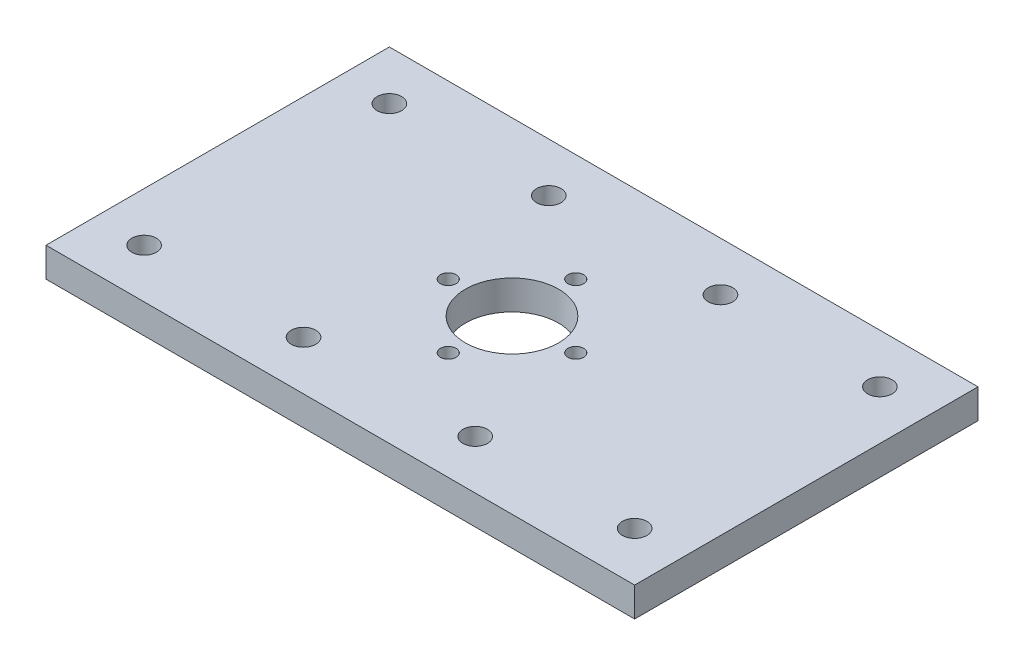
ISO-10303-21;
HEADER;
FILE_DESCRIPTION(('STEP AP214'),'2;1');
FILE_NAME('part.step','',(''),(''),'','','');
FILE_SCHEMA(('AUTOMOTIVE_DESIGN { 1 0 10303 214 1 1 1 1 }'));
ENDSEC;
DATA;
#1=APPLICATION_CONTEXT('core data for automotive mechanical design processes');
#2=APPLICATION_PROTOCOL_DEFINITION('international standard','automotive_design',2000,#1);
#3=PRODUCT_CONTEXT('',#1,'mechanical');
#4=PRODUCT('Part','Part','',(#3));
#5=PRODUCT_RELATED_PRODUCT_CATEGORY('part','',(#4));
#6=PRODUCT_DEFINITION_FORMATION('','',#4);
#7=PRODUCT_DEFINITION_CONTEXT('part definition',#1,'design');
#8=PRODUCT_DEFINITION('design','',#6,#7);
#9=PRODUCT_DEFINITION_SHAPE('','',#8);
#10=(LENGTH_UNIT() NAMED_UNIT(*) SI_UNIT(.MILLI.,.METRE.));
#11=(NAMED_UNIT(*) PLANE_ANGLE_UNIT() SI_UNIT($,.RADIAN.));
#12=(NAMED_UNIT(*) SI_UNIT($,.STERADIAN.) SOLID_ANGLE_UNIT());
#13=UNCERTAINTY_MEASURE_WITH_UNIT(LENGTH_MEASURE(1.E-05),#10,'distance_accuracy_value','');
#14=(GEOMETRIC_REPRESENTATION_CONTEXT(3) GLOBAL_UNCERTAINTY_ASSIGNED_CONTEXT((#13)) GLOBAL_UNIT_ASSIGNED_CONTEXT((#10,
#11,#12)) REPRESENTATION_CONTEXT('',''));
#15=CARTESIAN_POINT('',(0.,0.,0.));
#16=DIRECTION('',(0.,0.,1.));
#17=DIRECTION('',(1.,0.,0.));
#18=AXIS2_PLACEMENT_3D('',#15,#16,#17);
#19=CARTESIAN_POINT('',(0.,6.,0.));
#20=DIRECTION('',(0.,1.,0.));
#21=DIRECTION('',(0.,0.,1.));
#22=AXIS2_PLACEMENT_3D('',#19,#20,#21);
#23=PLANE('',#22);
#24=CARTESIAN_POINT('',(13.,6.,2.30718222304915E-13));
#25=DIRECTION('',(0.,-1.,0.));
#26=DIRECTION('',(0.,0.,-1.));
#27=AXIS2_PLACEMENT_3D('',#24,#25,#26);
#28=CIRCLE('',#27,1.6);
#29=CARTESIAN_POINT('',(13.,6.,-1.59999999999977));
#30=VERTEX_POINT('',#29);
#31=EDGE_CURVE('E200',#30,#30,#28,.T.);
#32=ORIENTED_EDGE('',*,*,#31,.T.);
#33=EDGE_LOOP('',(#32));
#34=FACE_BOUND('',#33,.T.);
#35=CARTESIAN_POINT('',(-2.76688394418301E-13,6.,13.));
#36=DIRECTION('',(0.,-1.,0.));
#37=DIRECTION('',(0.,0.,-1.));
#38=AXIS2_PLACEMENT_3D('',#35,#36,#37);
#39=CIRCLE('',#38,1.6);
#40=CARTESIAN_POINT('',(-2.76688394418301E-13,6.,11.4));
#41=VERTEX_POINT('',#40);
#42=EDGE_CURVE('E191',#41,#41,#39,.T.);
#43=ORIENTED_EDGE('',*,*,#42,.T.);
#44=EDGE_LOOP('',(#43));
#45=FACE_BOUND('',#44,.T.);
#46=CARTESIAN_POINT('',(-13.,6.,-3.17724801834725E-13));
#47=DIRECTION('',(0.,-1.,0.));
#48=DIRECTION('',(0.,0.,-1.));
#49=AXIS2_PLACEMENT_3D('',#46,#47,#48);
#50=CIRCLE('',#49,1.6);
#51=CARTESIAN_POINT('',(-13.,6.,-1.60000000000032));
#52=VERTEX_POINT('',#51);
#53=EDGE_CURVE('E182',#52,#52,#50,.T.);
#54=ORIENTED_EDGE('',*,*,#53,.T.);
#55=EDGE_LOOP('',(#54));
#56=FACE_BOUND('',#55,.T.);
#57=CARTESIAN_POINT('',(50.,6.,-25.));
#58=DIRECTION('',(0.,1.,0.));
#59=DIRECTION('',(0.,0.,-1.));
#60=AXIS2_PLACEMENT_3D('',#57,#58,#59);
#61=CIRCLE('',#60,2.5);
#62=CARTESIAN_POINT('',(50.,6.,-27.5));
#63=VERTEX_POINT('',#62);
#64=EDGE_CURVE('E165',#63,#63,#61,.T.);
#65=ORIENTED_EDGE('',*,*,#64,.F.);
#66=EDGE_LOOP('',(#65));
#67=FACE_BOUND('',#66,.T.);
#68=CARTESIAN_POINT('',(-50.,6.,25.));
#69=DIRECTION('',(0.,1.,0.));
#70=DIRECTION('',(0.,0.,-1.));
#71=AXIS2_PLACEMENT_3D('',#68,#69,#70);
#72=CIRCLE('',#71,2.5);
#73=CARTESIAN_POINT('',(-50.,6.,22.5));
#74=VERTEX_POINT('',#73);
#75=EDGE_CURVE('E153',#74,#74,#72,.T.);
#76=ORIENTED_EDGE('',*,*,#75,.F.);
#77=EDGE_LOOP('',(#76));
#78=FACE_BOUND('',#77,.T.);
#79=CARTESIAN_POINT('',(-17.5,6.,25.));
#80=DIRECTION('',(0.,1.,0.));
#81=DIRECTION('',(0.,0.,-1.));
#82=AXIS2_PLACEMENT_3D('',#79,#80,#81);
#83=CIRCLE('',#82,2.5);
#84=CARTESIAN_POINT('',(-17.5,6.,22.5));
#85=VERTEX_POINT('',#84);
#86=EDGE_CURVE('E141',#85,#85,#83,.T.);
#87=ORIENTED_EDGE('',*,*,#86,.F.);
#88=EDGE_LOOP('',(#87));
#89=FACE_BOUND('',#88,.T.);
#90=CARTESIAN_POINT('',(17.5,6.,-25.));
#91=DIRECTION('',(0.,1.,0.));
#92=DIRECTION('',(0.,0.,-1.));
#93=AXIS2_PLACEMENT_3D('',#90,#91,#92);
#94=CIRCLE('',#93,2.5);
#95=CARTESIAN_POINT('',(17.5,6.,-27.5));
#96=VERTEX_POINT('',#95);
#97=EDGE_CURVE('E129',#96,#96,#94,.T.);
#98=ORIENTED_EDGE('',*,*,#97,.F.);
#99=EDGE_LOOP('',(#98));
#100=FACE_BOUND('',#99,.T.);
#101=CARTESIAN_POINT('',(0.,6.,0.));
#102=DIRECTION('',(0.,1.,0.));
#103=DIRECTION('',(0.,0.,1.));
#104=AXIS2_PLACEMENT_3D('',#101,#102,#103);
#105=CIRCLE('',#104,9.5);
#106=CARTESIAN_POINT('',(0.,6.,9.5));
#107=VERTEX_POINT('',#106);
#108=EDGE_CURVE('E108',#107,#107,#105,.T.);
#109=ORIENTED_EDGE('',*,*,#108,.F.);
#110=EDGE_LOOP('',(#109));
#111=FACE_BOUND('',#110,.T.);
#112=DIRECTION('',(0.,0.,-1.));
#113=VECTOR('',#112,1.);
#114=CARTESIAN_POINT('',(60.,6.,-35.));
#115=LINE('',#114,#113);
#116=CARTESIAN_POINT('',(60.,6.,35.));
#117=VERTEX_POINT('',#116);
#118=CARTESIAN_POINT('',(60.,6.,-35.));
#119=VERTEX_POINT('',#118);
#120=EDGE_CURVE('E93',#117,#119,#115,.T.);
#121=ORIENTED_EDGE('',*,*,#120,.T.);
#122=DIRECTION('',(-1.,0.,0.));
#123=VECTOR('',#122,1.);
#124=CARTESIAN_POINT('',(-60.,6.,-35.));
#125=LINE('',#124,#123);
#126=CARTESIAN_POINT('',(-60.,6.,-35.));
#127=VERTEX_POINT('',#126);
#128=EDGE_CURVE('E88',#119,#127,#125,.T.);
#129=ORIENTED_EDGE('',*,*,#128,.T.);
#130=DIRECTION('',(0.,0.,1.));
#131=VECTOR('',#130,1.);
#132=CARTESIAN_POINT('',(-60.,6.,-35.));
#133=LINE('',#132,#131);
#134=CARTESIAN_POINT('',(-60.,6.,35.));
#135=VERTEX_POINT('',#134);
#136=EDGE_CURVE('E91',#127,#135,#133,.T.);
#137=ORIENTED_EDGE('',*,*,#136,.T.);
#138=DIRECTION('',(1.,0.,0.));
#139=VECTOR('',#138,1.);
#140=CARTESIAN_POINT('',(-60.,6.,35.));
#141=LINE('',#140,#139);
#142=EDGE_CURVE('E58',#135,#117,#141,.T.);
#143=ORIENTED_EDGE('',*,*,#142,.T.);
#144=EDGE_LOOP('',(#121,#129,#137,#143));
#145=FACE_BOUND('',#144,.T.);
#146=CARTESIAN_POINT('',(-17.5,6.,-25.));
#147=DIRECTION('',(0.,1.,0.));
#148=DIRECTION('',(0.,0.,1.));
#149=AXIS2_PLACEMENT_3D('',#146,#147,#148);
#150=CIRCLE('',#149,2.5);
#151=CARTESIAN_POINT('',(-17.5,6.,-22.5));
#152=VERTEX_POINT('',#151);
#153=EDGE_CURVE('E123',#152,#152,#150,.T.);
#154=ORIENTED_EDGE('',*,*,#153,.F.);
#155=EDGE_LOOP('',(#154));
#156=FACE_BOUND('',#155,.T.);
#157=CARTESIAN_POINT('',(17.5,6.,25.));
#158=DIRECTION('',(0.,1.,0.));
#159=DIRECTION('',(0.,0.,1.));
#160=AXIS2_PLACEMENT_3D('',#157,#158,#159);
#161=CIRCLE('',#160,2.5);
#162=CARTESIAN_POINT('',(17.5,6.,27.5));
#163=VERTEX_POINT('',#162);
#164=EDGE_CURVE('E135',#163,#163,#161,.T.);
#165=ORIENTED_EDGE('',*,*,#164,.F.);
#166=EDGE_LOOP('',(#165));
#167=FACE_BOUND('',#166,.T.);
#168=CARTESIAN_POINT('',(-50.,6.,-25.));
#169=DIRECTION('',(0.,1.,0.));
#170=DIRECTION('',(0.,0.,1.));
#171=AXIS2_PLACEMENT_3D('',#168,#169,#170);
#172=CIRCLE('',#171,2.5);
#173=CARTESIAN_POINT('',(-50.,6.,-22.5));
#174=VERTEX_POINT('',#173);
#175=EDGE_CURVE('E147',#174,#174,#172,.T.);
#176=ORIENTED_EDGE('',*,*,#175,.F.);
#177=EDGE_LOOP('',(#176));
#178=FACE_BOUND('',#177,.T.);
#179=CARTESIAN_POINT('',(50.,6.,25.));
#180=DIRECTION('',(0.,1.,0.));
#181=DIRECTION('',(0.,0.,1.));
#182=AXIS2_PLACEMENT_3D('',#179,#180,#181);
#183=CIRCLE('',#182,2.5);
#184=CARTESIAN_POINT('',(50.,6.,27.5));
#185=VERTEX_POINT('',#184);
#186=EDGE_CURVE('E159',#185,#185,#183,.T.);
#187=ORIENTED_EDGE('',*,*,#186,.F.);
#188=EDGE_LOOP('',(#187));
#189=FACE_BOUND('',#188,.T.);
#190=CARTESIAN_POINT('',(0.,6.,-13.));
#191=DIRECTION('',(0.,-1.,0.));
#192=DIRECTION('',(0.,0.,-1.));
#193=AXIS2_PLACEMENT_3D('',#190,#191,#192);
#194=CIRCLE('',#193,1.6);
#195=CARTESIAN_POINT('',(0.,6.,-14.6));
#196=VERTEX_POINT('',#195);
#197=EDGE_CURVE('E171',#196,#196,#194,.T.);
#198=ORIENTED_EDGE('',*,*,#197,.T.);
#199=EDGE_LOOP('',(#198));
#200=FACE_BOUND('',#199,.T.);
#201=ADVANCED_FACE('F41',(#34,#45,#56,#67,#78,#89,#100,#111,#145,#156,#167,#178,#189,#200),#23,.T.);
#202=CARTESIAN_POINT('',(0.,0.,0.));
#203=DIRECTION('',(0.,1.,0.));
#204=DIRECTION('',(0.,0.,1.));
#205=AXIS2_PLACEMENT_3D('',#202,#203,#204);
#206=PLANE('',#205);
#207=CARTESIAN_POINT('',(13.,0.,2.30718222304915E-13));
#208=DIRECTION('',(0.,-1.,0.));
#209=DIRECTION('',(0.,0.,-1.));
#210=AXIS2_PLACEMENT_3D('',#207,#208,#209);
#211=CIRCLE('',#210,3.15);
#212=CARTESIAN_POINT('',(13.,0.,-3.14999999999977));
#213=VERTEX_POINT('',#212);
#214=EDGE_CURVE('E206',#213,#213,#211,.T.);
#215=ORIENTED_EDGE('',*,*,#214,.F.);
#216=EDGE_LOOP('',(#215));
#217=FACE_BOUND('',#216,.T.);
#218=CARTESIAN_POINT('',(-2.76688394418301E-13,0.,13.));
#219=DIRECTION('',(0.,-1.,0.));
#220=DIRECTION('',(0.,0.,-1.));
#221=AXIS2_PLACEMENT_3D('',#218,#219,#220);
#222=CIRCLE('',#221,3.15);
#223=CARTESIAN_POINT('',(-2.76688394418301E-13,0.,9.85));
#224=VERTEX_POINT('',#223);
#225=EDGE_CURVE('E197',#224,#224,#222,.T.);
#226=ORIENTED_EDGE('',*,*,#225,.F.);
#227=EDGE_LOOP('',(#226));
#228=FACE_BOUND('',#227,.T.);
#229=CARTESIAN_POINT('',(-13.,0.,-3.17724801834725E-13));
#230=DIRECTION('',(0.,-1.,0.));
#231=DIRECTION('',(0.,0.,-1.));
#232=AXIS2_PLACEMENT_3D('',#229,#230,#231);
#233=CIRCLE('',#232,3.15);
#234=CARTESIAN_POINT('',(-13.,0.,-3.15000000000032));
#235=VERTEX_POINT('',#234);
#236=EDGE_CURVE('E188',#235,#235,#233,.T.);
#237=ORIENTED_EDGE('',*,*,#236,.F.);
#238=EDGE_LOOP('',(#237));
#239=FACE_BOUND('',#238,.T.);
#240=DIRECTION('',(0.,0.,-1.));
#241=VECTOR('',#240,1.);
#242=CARTESIAN_POINT('',(60.,0.,-35.));
#243=LINE('',#242,#241);
#244=CARTESIAN_POINT('',(60.,0.,35.));
#245=VERTEX_POINT('',#244);
#246=CARTESIAN_POINT('',(60.,0.,-35.));
#247=VERTEX_POINT('',#246);
#248=EDGE_CURVE('E105',#245,#247,#243,.T.);
#249=ORIENTED_EDGE('',*,*,#248,.F.);
#250=DIRECTION('',(1.,0.,0.));
#251=VECTOR('',#250,1.);
#252=CARTESIAN_POINT('',(-60.,0.,35.));
#253=LINE('',#252,#251);
#254=CARTESIAN_POINT('',(-60.,0.,35.));
#255=VERTEX_POINT('',#254);
#256=EDGE_CURVE('E81',#255,#245,#253,.T.);
#257=ORIENTED_EDGE('',*,*,#256,.F.);
#258=DIRECTION('',(0.,0.,1.));
#259=VECTOR('',#258,1.);
#260=CARTESIAN_POINT('',(-60.,0.,-35.));
#261=LINE('',#260,#259);
#262=CARTESIAN_POINT('',(-60.,0.,-35.));
#263=VERTEX_POINT('',#262);
#264=EDGE_CURVE('E75',#263,#255,#261,.T.);
#265=ORIENTED_EDGE('',*,*,#264,.F.);
#266=DIRECTION('',(-1.,0.,0.));
#267=VECTOR('',#266,1.);
#268=CARTESIAN_POINT('',(-60.,0.,-35.));
#269=LINE('',#268,#267);
#270=EDGE_CURVE('E97',#247,#263,#269,.T.);
#271=ORIENTED_EDGE('',*,*,#270,.F.);
#272=EDGE_LOOP('',(#249,#257,#265,#271));
#273=FACE_BOUND('',#272,.T.);
#274=CARTESIAN_POINT('',(0.,0.,0.));
#275=DIRECTION('',(0.,1.,0.));
#276=DIRECTION('',(0.,0.,1.));
#277=AXIS2_PLACEMENT_3D('',#274,#275,#276);
#278=CIRCLE('',#277,9.5);
#279=CARTESIAN_POINT('',(0.,0.,9.5));
#280=VERTEX_POINT('',#279);
#281=EDGE_CURVE('E120',#280,#280,#278,.T.);
#282=ORIENTED_EDGE('',*,*,#281,.T.);
#283=EDGE_LOOP('',(#282));
#284=FACE_BOUND('',#283,.T.);
#285=CARTESIAN_POINT('',(-17.5,0.,-25.));
#286=DIRECTION('',(0.,1.,0.));
#287=DIRECTION('',(0.,0.,1.));
#288=AXIS2_PLACEMENT_3D('',#285,#286,#287);
#289=CIRCLE('',#288,2.5);
#290=CARTESIAN_POINT('',(-17.5,0.,-22.5));
#291=VERTEX_POINT('',#290);
#292=EDGE_CURVE('E126',#291,#291,#289,.T.);
#293=ORIENTED_EDGE('',*,*,#292,.T.);
#294=EDGE_LOOP('',(#293));
#295=FACE_BOUND('',#294,.T.);
#296=CARTESIAN_POINT('',(17.5,0.,-25.));
#297=DIRECTION('',(0.,1.,0.));
#298=DIRECTION('',(0.,0.,-1.));
#299=AXIS2_PLACEMENT_3D('',#296,#297,#298);
#300=CIRCLE('',#299,2.5);
#301=CARTESIAN_POINT('',(17.5,0.,-27.5));
#302=VERTEX_POINT('',#301);
#303=EDGE_CURVE('E132',#302,#302,#300,.T.);
#304=ORIENTED_EDGE('',*,*,#303,.T.);
#305=EDGE_LOOP('',(#304));
#306=FACE_BOUND('',#305,.T.);
#307=CARTESIAN_POINT('',(17.5,0.,25.));
#308=DIRECTION('',(0.,1.,0.));
#309=DIRECTION('',(0.,0.,1.));
#310=AXIS2_PLACEMENT_3D('',#307,#308,#309);
#311=CIRCLE('',#310,2.5);
#312=CARTESIAN_POINT('',(17.5,0.,27.5));
#313=VERTEX_POINT('',#312);
#314=EDGE_CURVE('E138',#313,#313,#311,.T.);
#315=ORIENTED_EDGE('',*,*,#314,.T.);
#316=EDGE_LOOP('',(#315));
#317=FACE_BOUND('',#316,.T.);
#318=CARTESIAN_POINT('',(-17.5,0.,25.));
#319=DIRECTION('',(0.,1.,0.));
#320=DIRECTION('',(0.,0.,-1.));
#321=AXIS2_PLACEMENT_3D('',#318,#319,#320);
#322=CIRCLE('',#321,2.5);
#323=CARTESIAN_POINT('',(-17.5,0.,22.5));
#324=VERTEX_POINT('',#323);
#325=EDGE_CURVE('E144',#324,#324,#322,.T.);
#326=ORIENTED_EDGE('',*,*,#325,.T.);
#327=EDGE_LOOP('',(#326));
#328=FACE_BOUND('',#327,.T.);
#329=CARTESIAN_POINT('',(-50.,0.,-25.));
#330=DIRECTION('',(0.,1.,0.));
#331=DIRECTION('',(0.,0.,1.));
#332=AXIS2_PLACEMENT_3D('',#329,#330,#331);
#333=CIRCLE('',#332,2.5);
#334=CARTESIAN_POINT('',(-50.,0.,-22.5));
#335=VERTEX_POINT('',#334);
#336=EDGE_CURVE('E150',#335,#335,#333,.T.);
#337=ORIENTED_EDGE('',*,*,#336,.T.);
#338=EDGE_LOOP('',(#337));
#339=FACE_BOUND('',#338,.T.);
#340=CARTESIAN_POINT('',(-50.,0.,25.));
#341=DIRECTION('',(0.,1.,0.));
#342=DIRECTION('',(0.,0.,-1.));
#343=AXIS2_PLACEMENT_3D('',#340,#341,#342);
#344=CIRCLE('',#343,2.5);
#345=CARTESIAN_POINT('',(-50.,0.,22.5));
#346=VERTEX_POINT('',#345);
#347=EDGE_CURVE('E156',#346,#346,#344,.T.);
#348=ORIENTED_EDGE('',*,*,#347,.T.);
#349=EDGE_LOOP('',(#348));
#350=FACE_BOUND('',#349,.T.);
#351=CARTESIAN_POINT('',(50.,0.,25.));
#352=DIRECTION('',(0.,1.,0.));
#353=DIRECTION('',(0.,0.,1.));
#354=AXIS2_PLACEMENT_3D('',#351,#352,#353);
#355=CIRCLE('',#354,2.5);
#356=CARTESIAN_POINT('',(50.,0.,27.5));
#357=VERTEX_POINT('',#356);
#358=EDGE_CURVE('E162',#357,#357,#355,.T.);
#359=ORIENTED_EDGE('',*,*,#358,.T.);
#360=EDGE_LOOP('',(#359));
#361=FACE_BOUND('',#360,.T.);
#362=CARTESIAN_POINT('',(50.,0.,-25.));
#363=DIRECTION('',(0.,1.,0.));
#364=DIRECTION('',(0.,0.,-1.));
#365=AXIS2_PLACEMENT_3D('',#362,#363,#364);
#366=CIRCLE('',#365,2.5);
#367=CARTESIAN_POINT('',(50.,0.,-27.5));
#368=VERTEX_POINT('',#367);
#369=EDGE_CURVE('E168',#368,#368,#366,.T.);
#370=ORIENTED_EDGE('',*,*,#369,.T.);
#371=EDGE_LOOP('',(#370));
#372=FACE_BOUND('',#371,.T.);
#373=CARTESIAN_POINT('',(0.,0.,-13.));
#374=DIRECTION('',(0.,-1.,0.));
#375=DIRECTION('',(0.,0.,-1.));
#376=AXIS2_PLACEMENT_3D('',#373,#374,#375);
#377=CIRCLE('',#376,3.15);
#378=CARTESIAN_POINT('',(0.,0.,-16.15));
#379=VERTEX_POINT('',#378);
#380=EDGE_CURVE('E179',#379,#379,#377,.T.);
#381=ORIENTED_EDGE('',*,*,#380,.F.);
#382=EDGE_LOOP('',(#381));
#383=FACE_BOUND('',#382,.T.);
#384=ADVANCED_FACE('F116',(#217,#228,#239,#273,#284,#295,#306,#317,#328,#339,#350,#361,#372,
#383),#206,.F.);
#385=CARTESIAN_POINT('',(60.,6.,-35.));
#386=DIRECTION('',(-1.,0.,0.));
#387=DIRECTION('',(0.,0.,1.));
#388=AXIS2_PLACEMENT_3D('',#385,#386,#387);
#389=PLANE('',#388);
#390=ORIENTED_EDGE('',*,*,#248,.T.);
#391=DIRECTION('',(0.,-1.,0.));
#392=VECTOR('',#391,1.);
#393=CARTESIAN_POINT('',(60.,6.,-35.));
#394=LINE('',#393,#392);
#395=EDGE_CURVE('E11',#119,#247,#394,.T.);
#396=ORIENTED_EDGE('',*,*,#395,.F.);
#397=ORIENTED_EDGE('',*,*,#120,.F.);
#398=DIRECTION('',(0.,-1.,0.));
#399=VECTOR('',#398,1.);
#400=CARTESIAN_POINT('',(60.,6.,35.));
#401=LINE('',#400,#399);
#402=EDGE_CURVE('E101',#117,#245,#401,.T.);
#403=ORIENTED_EDGE('',*,*,#402,.T.);
#404=EDGE_LOOP('',(#390,#396,#397,#403));
#405=FACE_BOUND('',#404,.T.);
#406=ADVANCED_FACE('F43',(#405),#389,.F.);
#407=CARTESIAN_POINT('',(-60.,6.,-35.));
#408=DIRECTION('',(0.,0.,1.));
#409=DIRECTION('',(1.,0.,0.));
#410=AXIS2_PLACEMENT_3D('',#407,#408,#409);
#411=PLANE('',#410);
#412=ORIENTED_EDGE('',*,*,#270,.T.);
#413=DIRECTION('',(0.,-1.,0.));
#414=VECTOR('',#413,1.);
#415=CARTESIAN_POINT('',(-60.,6.,-35.));
#416=LINE('',#415,#414);
#417=EDGE_CURVE('E50',#127,#263,#416,.T.);
#418=ORIENTED_EDGE('',*,*,#417,.F.);
#419=ORIENTED_EDGE('',*,*,#128,.F.);
#420=ORIENTED_EDGE('',*,*,#395,.T.);
#421=EDGE_LOOP('',(#412,#418,#419,#420));
#422=FACE_BOUND('',#421,.T.);
#423=ADVANCED_FACE('F96',(#422),#411,.F.);
#424=CARTESIAN_POINT('',(-60.,6.,-35.));
#425=DIRECTION('',(1.,0.,0.));
#426=DIRECTION('',(0.,0.,-1.));
#427=AXIS2_PLACEMENT_3D('',#424,#425,#426);
#428=PLANE('',#427);
#429=ORIENTED_EDGE('',*,*,#264,.T.);
#430=DIRECTION('',(0.,-1.,0.));
#431=VECTOR('',#430,1.);
#432=CARTESIAN_POINT('',(-60.,6.,35.));
#433=LINE('',#432,#431);
#434=EDGE_CURVE('E98',#135,#255,#433,.T.);
#435=ORIENTED_EDGE('',*,*,#434,.F.);
#436=ORIENTED_EDGE('',*,*,#136,.F.);
#437=ORIENTED_EDGE('',*,*,#417,.T.);
#438=EDGE_LOOP('',(#429,#435,#436,#437));
#439=FACE_BOUND('',#438,.T.);
#440=ADVANCED_FACE('F99',(#439),#428,.F.);
#441=CARTESIAN_POINT('',(-60.,6.,35.));
#442=DIRECTION('',(0.,0.,-1.));
#443=DIRECTION('',(-1.,0.,0.));
#444=AXIS2_PLACEMENT_3D('',#441,#442,#443);
#445=PLANE('',#444);
#446=ORIENTED_EDGE('',*,*,#256,.T.);
#447=ORIENTED_EDGE('',*,*,#402,.F.);
#448=ORIENTED_EDGE('',*,*,#142,.F.);
#449=ORIENTED_EDGE('',*,*,#434,.T.);
#450=EDGE_LOOP('',(#446,#447,#448,#449));
#451=FACE_BOUND('',#450,.T.);
#452=ADVANCED_FACE('F113',(#451),#445,.F.);
#453=CARTESIAN_POINT('',(0.,6.,0.));
#454=DIRECTION('',(0.,-1.,0.));
#455=DIRECTION('',(0.,0.,-1.));
#456=AXIS2_PLACEMENT_3D('',#453,#454,#455);
#457=CYLINDRICAL_SURFACE('',#456,9.5);
#458=ORIENTED_EDGE('',*,*,#108,.T.);
#459=EDGE_LOOP('',(#458));
#460=FACE_BOUND('',#459,.T.);
#461=ORIENTED_EDGE('',*,*,#281,.F.);
#462=EDGE_LOOP('',(#461));
#463=FACE_BOUND('',#462,.T.);
#464=ADVANCED_FACE('F244',(#460,#463),#457,.F.);
#465=CARTESIAN_POINT('',(-17.5,6.,-25.));
#466=DIRECTION('',(0.,-1.,0.));
#467=DIRECTION('',(0.,0.,-1.));
#468=AXIS2_PLACEMENT_3D('',#465,#466,#467);
#469=CYLINDRICAL_SURFACE('',#468,2.5);
#470=ORIENTED_EDGE('',*,*,#153,.T.);
#471=EDGE_LOOP('',(#470));
#472=FACE_BOUND('',#471,.T.);
#473=ORIENTED_EDGE('',*,*,#292,.F.);
#474=EDGE_LOOP('',(#473));
#475=FACE_BOUND('',#474,.T.);
#476=ADVANCED_FACE('F282',(#472,#475),#469,.F.);
#477=CARTESIAN_POINT('',(17.5,6.,-25.));
#478=DIRECTION('',(0.,-1.,0.));
#479=DIRECTION('',(0.,0.,-1.));
#480=AXIS2_PLACEMENT_3D('',#477,#478,#479);
#481=CYLINDRICAL_SURFACE('',#480,2.5);
#482=ORIENTED_EDGE('',*,*,#97,.T.);
#483=EDGE_LOOP('',(#482));
#484=FACE_BOUND('',#483,.T.);
#485=ORIENTED_EDGE('',*,*,#303,.F.);
#486=EDGE_LOOP('',(#485));
#487=FACE_BOUND('',#486,.T.);
#488=ADVANCED_FACE('F291',(#484,#487),#481,.F.);
#489=CARTESIAN_POINT('',(17.5,6.,25.));
#490=DIRECTION('',(0.,-1.,0.));
#491=DIRECTION('',(0.,0.,-1.));
#492=AXIS2_PLACEMENT_3D('',#489,#490,#491);
#493=CYLINDRICAL_SURFACE('',#492,2.5);
#494=ORIENTED_EDGE('',*,*,#164,.T.);
#495=EDGE_LOOP('',(#494));
#496=FACE_BOUND('',#495,.T.);
#497=ORIENTED_EDGE('',*,*,#314,.F.);
#498=EDGE_LOOP('',(#497));
#499=FACE_BOUND('',#498,.T.);
#500=ADVANCED_FACE('F300',(#496,#499),#493,.F.);
#501=CARTESIAN_POINT('',(-17.5,6.,25.));
#502=DIRECTION('',(0.,-1.,0.));
#503=DIRECTION('',(0.,0.,-1.));
#504=AXIS2_PLACEMENT_3D('',#501,#502,#503);
#505=CYLINDRICAL_SURFACE('',#504,2.5);
#506=ORIENTED_EDGE('',*,*,#86,.T.);
#507=EDGE_LOOP('',(#506));
#508=FACE_BOUND('',#507,.T.);
#509=ORIENTED_EDGE('',*,*,#325,.F.);
#510=EDGE_LOOP('',(#509));
#511=FACE_BOUND('',#510,.T.);
#512=ADVANCED_FACE('F310',(#508,#511),#505,.F.);
#513=CARTESIAN_POINT('',(-50.,6.,-25.));
#514=DIRECTION('',(0.,-1.,0.));
#515=DIRECTION('',(0.,0.,-1.));
#516=AXIS2_PLACEMENT_3D('',#513,#514,#515);
#517=CYLINDRICAL_SURFACE('',#516,2.5);
#518=ORIENTED_EDGE('',*,*,#175,.T.);
#519=EDGE_LOOP('',(#518));
#520=FACE_BOUND('',#519,.T.);
#521=ORIENTED_EDGE('',*,*,#336,.F.);
#522=EDGE_LOOP('',(#521));
#523=FACE_BOUND('',#522,.T.);
#524=ADVANCED_FACE('F320',(#520,#523),#517,.F.);
#525=CARTESIAN_POINT('',(-50.,6.,25.));
#526=DIRECTION('',(0.,-1.,0.));
#527=DIRECTION('',(0.,0.,-1.));
#528=AXIS2_PLACEMENT_3D('',#525,#526,#527);
#529=CYLINDRICAL_SURFACE('',#528,2.5);
#530=ORIENTED_EDGE('',*,*,#75,.T.);
#531=EDGE_LOOP('',(#530));
#532=FACE_BOUND('',#531,.T.);
#533=ORIENTED_EDGE('',*,*,#347,.F.);
#534=EDGE_LOOP('',(#533));
#535=FACE_BOUND('',#534,.T.);
#536=ADVANCED_FACE('F330',(#532,#535),#529,.F.);
#537=CARTESIAN_POINT('',(50.,6.,25.));
#538=DIRECTION('',(0.,-1.,0.));
#539=DIRECTION('',(0.,0.,-1.));
#540=AXIS2_PLACEMENT_3D('',#537,#538,#539);
#541=CYLINDRICAL_SURFACE('',#540,2.5);
#542=ORIENTED_EDGE('',*,*,#186,.T.);
#543=EDGE_LOOP('',(#542));
#544=FACE_BOUND('',#543,.T.);
#545=ORIENTED_EDGE('',*,*,#358,.F.);
#546=EDGE_LOOP('',(#545));
#547=FACE_BOUND('',#546,.T.);
#548=ADVANCED_FACE('F340',(#544,#547),#541,.F.);
#549=CARTESIAN_POINT('',(50.,6.,-25.));
#550=DIRECTION('',(0.,-1.,0.));
#551=DIRECTION('',(0.,0.,-1.));
#552=AXIS2_PLACEMENT_3D('',#549,#550,#551);
#553=CYLINDRICAL_SURFACE('',#552,2.5);
#554=ORIENTED_EDGE('',*,*,#64,.T.);
#555=EDGE_LOOP('',(#554));
#556=FACE_BOUND('',#555,.T.);
#557=ORIENTED_EDGE('',*,*,#369,.F.);
#558=EDGE_LOOP('',(#557));
#559=FACE_BOUND('',#558,.T.);
#560=ADVANCED_FACE('F350',(#556,#559),#553,.F.);
#561=CARTESIAN_POINT('',(0.,0.,-13.));
#562=DIRECTION('',(0.,-1.,0.));
#563=DIRECTION('',(0.,0.,-1.));
#564=AXIS2_PLACEMENT_3D('',#561,#562,#563);
#565=CYLINDRICAL_SURFACE('',#564,1.6);
#566=ORIENTED_EDGE('',*,*,#197,.F.);
#567=EDGE_LOOP('',(#566));
#568=FACE_BOUND('',#567,.T.);
#569=CARTESIAN_POINT('',(0.,1.55,-13.));
#570=DIRECTION('',(0.,-1.,0.));
#571=DIRECTION('',(0.,0.,-1.));
#572=AXIS2_PLACEMENT_3D('',#569,#570,#571);
#573=CIRCLE('',#572,1.6);
#574=CARTESIAN_POINT('',(0.,1.55,-14.6));
#575=VERTEX_POINT('',#574);
#576=EDGE_CURVE('E176',#575,#575,#573,.T.);
#577=ORIENTED_EDGE('',*,*,#576,.T.);
#578=EDGE_LOOP('',(#577));
#579=FACE_BOUND('',#578,.T.);
#580=ADVANCED_FACE('F359',(#568,#579),#565,.F.);
#581=CARTESIAN_POINT('',(0.,0.,-13.));
#582=DIRECTION('',(0.,-1.,0.));
#583=DIRECTION('',(0.,0.,-1.));
#584=AXIS2_PLACEMENT_3D('',#581,#582,#583);
#585=CONICAL_SURFACE('',#584,3.15,0.785398163397448);
#586=ORIENTED_EDGE('',*,*,#576,.F.);
#587=EDGE_LOOP('',(#586));
#588=FACE_BOUND('',#587,.T.);
#589=ORIENTED_EDGE('',*,*,#380,.T.);
#590=EDGE_LOOP('',(#589));
#591=FACE_BOUND('',#590,.T.);
#592=ADVANCED_FACE('F232',(#588,#591),#585,.F.);
#593=CARTESIAN_POINT('',(-13.,0.,-3.17724801834725E-13));
#594=DIRECTION('',(0.,-1.,0.));
#595=DIRECTION('',(0.,0.,-1.));
#596=AXIS2_PLACEMENT_3D('',#593,#594,#595);
#597=CYLINDRICAL_SURFACE('',#596,1.6);
#598=ORIENTED_EDGE('',*,*,#53,.F.);
#599=EDGE_LOOP('',(#598));
#600=FACE_BOUND('',#599,.T.);
#601=CARTESIAN_POINT('',(-13.,1.55,-3.17724801834725E-13));
#602=DIRECTION('',(0.,-1.,0.));
#603=DIRECTION('',(0.,0.,-1.));
#604=AXIS2_PLACEMENT_3D('',#601,#602,#603);
#605=CIRCLE('',#604,1.6);
#606=CARTESIAN_POINT('',(-13.,1.55,-1.60000000000032));
#607=VERTEX_POINT('',#606);
#608=EDGE_CURVE('E185',#607,#607,#605,.T.);
#609=ORIENTED_EDGE('',*,*,#608,.T.);
#610=EDGE_LOOP('',(#609));
#611=FACE_BOUND('',#610,.T.);
#612=ADVANCED_FACE('F222',(#600,#611),#597,.F.);
#613=CARTESIAN_POINT('',(-13.,0.,-3.17724801834725E-13));
#614=DIRECTION('',(0.,-1.,0.));
#615=DIRECTION('',(0.,0.,-1.));
#616=AXIS2_PLACEMENT_3D('',#613,#614,#615);
#617=CONICAL_SURFACE('',#616,3.15,0.785398163397448);
#618=ORIENTED_EDGE('',*,*,#608,.F.);
#619=EDGE_LOOP('',(#618));
#620=FACE_BOUND('',#619,.T.);
#621=ORIENTED_EDGE('',*,*,#236,.T.);
#622=EDGE_LOOP('',(#621));
#623=FACE_BOUND('',#622,.T.);
#624=ADVANCED_FACE('F219',(#620,#623),#617,.F.);
#625=CARTESIAN_POINT('',(-2.76688394418301E-13,0.,13.));
#626=DIRECTION('',(0.,-1.,0.));
#627=DIRECTION('',(0.,0.,-1.));
#628=AXIS2_PLACEMENT_3D('',#625,#626,#627);
#629=CYLINDRICAL_SURFACE('',#628,1.6);
#630=ORIENTED_EDGE('',*,*,#42,.F.);
#631=EDGE_LOOP('',(#630));
#632=FACE_BOUND('',#631,.T.);
#633=CARTESIAN_POINT('',(-2.76688394418301E-13,1.55,13.));
#634=DIRECTION('',(0.,-1.,0.));
#635=DIRECTION('',(0.,0.,-1.));
#636=AXIS2_PLACEMENT_3D('',#633,#634,#635);
#637=CIRCLE('',#636,1.6);
#638=CARTESIAN_POINT('',(-2.76688394418301E-13,1.55,11.4));
#639=VERTEX_POINT('',#638);
#640=EDGE_CURVE('E194',#639,#639,#637,.T.);
#641=ORIENTED_EDGE('',*,*,#640,.T.);
#642=EDGE_LOOP('',(#641));
#643=FACE_BOUND('',#642,.T.);
#644=ADVANCED_FACE('F221',(#632,#643),#629,.F.);
#645=CARTESIAN_POINT('',(-2.76688394418301E-13,0.,13.));
#646=DIRECTION('',(0.,-1.,0.));
#647=DIRECTION('',(0.,0.,-1.));
#648=AXIS2_PLACEMENT_3D('',#645,#646,#647);
#649=CONICAL_SURFACE('',#648,3.15,0.785398163397448);
#650=ORIENTED_EDGE('',*,*,#640,.F.);
#651=EDGE_LOOP('',(#650));
#652=FACE_BOUND('',#651,.T.);
#653=ORIENTED_EDGE('',*,*,#225,.T.);
#654=EDGE_LOOP('',(#653));
#655=FACE_BOUND('',#654,.T.);
#656=ADVANCED_FACE('F229',(#652,#655),#649,.F.);
#657=CARTESIAN_POINT('',(13.,0.,2.30718222304915E-13));
#658=DIRECTION('',(0.,-1.,0.));
#659=DIRECTION('',(0.,0.,-1.));
#660=AXIS2_PLACEMENT_3D('',#657,#658,#659);
#661=CYLINDRICAL_SURFACE('',#660,1.6);
#662=ORIENTED_EDGE('',*,*,#31,.F.);
#663=EDGE_LOOP('',(#662));
#664=FACE_BOUND('',#663,.T.);
#665=CARTESIAN_POINT('',(13.,1.55,2.30718222304915E-13));
#666=DIRECTION('',(0.,-1.,0.));
#667=DIRECTION('',(0.,0.,-1.));
#668=AXIS2_PLACEMENT_3D('',#665,#666,#667);
#669=CIRCLE('',#668,1.6);
#670=CARTESIAN_POINT('',(13.,1.55,-1.59999999999977));
#671=VERTEX_POINT('',#670);
#672=EDGE_CURVE('E203',#671,#671,#669,.T.);
#673=ORIENTED_EDGE('',*,*,#672,.T.);
#674=EDGE_LOOP('',(#673));
#675=FACE_BOUND('',#674,.T.);
#676=ADVANCED_FACE('F412',(#664,#675),#661,.F.);
#677=CARTESIAN_POINT('',(13.,0.,2.30718222304915E-13));
#678=DIRECTION('',(0.,-1.,0.));
#679=DIRECTION('',(0.,0.,-1.));
#680=AXIS2_PLACEMENT_3D('',#677,#678,#679);
#681=CONICAL_SURFACE('',#680,3.15,0.785398163397448);
#682=ORIENTED_EDGE('',*,*,#672,.F.);
#683=EDGE_LOOP('',(#682));
#684=FACE_BOUND('',#683,.T.);
#685=ORIENTED_EDGE('',*,*,#214,.T.);
#686=EDGE_LOOP('',(#685));
#687=FACE_BOUND('',#686,.T.);
#688=ADVANCED_FACE('F210',(#684,#687),#681,.F.);
#689=CLOSED_SHELL('',(#201,#384,#406,#423,#440,#452,#464,#476,#488,#500,#512,#524,#536,#548,
#560,#580,#592,#612,#624,#644,#656,#676,#688));
#690=MANIFOLD_SOLID_BREP('B2',#689);
#691=ADVANCED_BREP_SHAPE_REPRESENTATION('',(#18,#690),#14);
#692=SHAPE_DEFINITION_REPRESENTATION(#9,#691);
ENDSEC;
END-ISO-10303-21;
